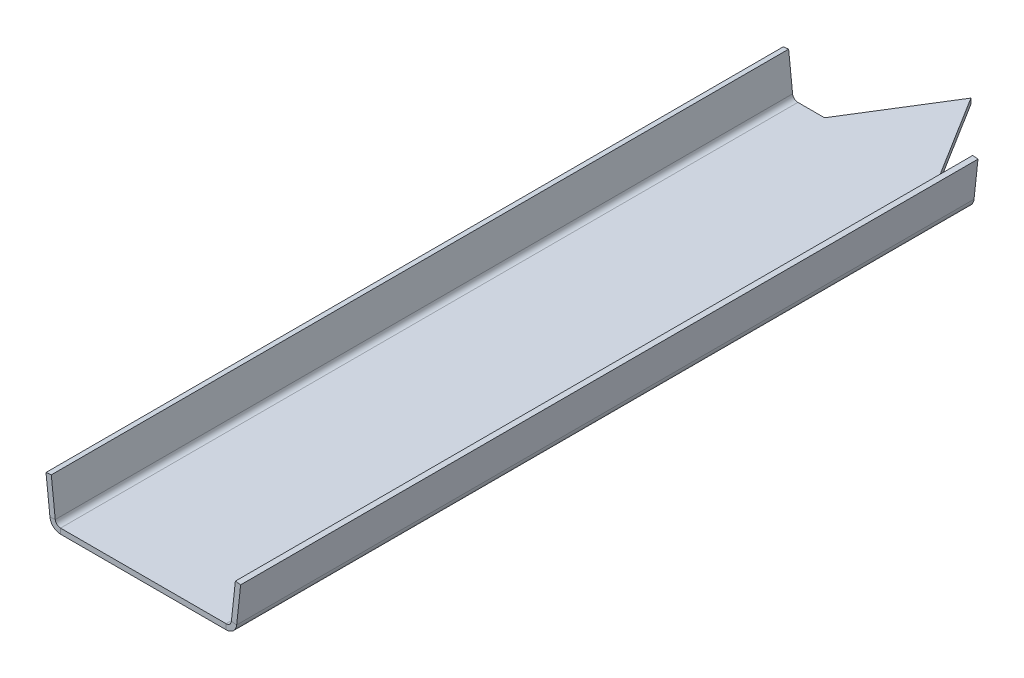
ISO-10303-21;
HEADER;
FILE_DESCRIPTION(('STEP AP214'),'2;1');
FILE_NAME('part.step','',(''),(''),'','','');
FILE_SCHEMA(('AUTOMOTIVE_DESIGN { 1 0 10303 214 1 1 1 1 }'));
ENDSEC;
DATA;
#1=APPLICATION_CONTEXT('core data for automotive mechanical design processes');
#2=APPLICATION_PROTOCOL_DEFINITION('international standard','automotive_design',2000,#1);
#3=PRODUCT_CONTEXT('',#1,'mechanical');
#4=PRODUCT('Part','Part','',(#3));
#5=PRODUCT_RELATED_PRODUCT_CATEGORY('part','',(#4));
#6=PRODUCT_DEFINITION_FORMATION('','',#4);
#7=PRODUCT_DEFINITION_CONTEXT('part definition',#1,'design');
#8=PRODUCT_DEFINITION('design','',#6,#7);
#9=PRODUCT_DEFINITION_SHAPE('','',#8);
#10=(LENGTH_UNIT() NAMED_UNIT(*) SI_UNIT(.MILLI.,.METRE.));
#11=(NAMED_UNIT(*) PLANE_ANGLE_UNIT() SI_UNIT($,.RADIAN.));
#12=(NAMED_UNIT(*) SI_UNIT($,.STERADIAN.) SOLID_ANGLE_UNIT());
#13=UNCERTAINTY_MEASURE_WITH_UNIT(LENGTH_MEASURE(1.E-05),#10,'distance_accuracy_value','');
#14=(GEOMETRIC_REPRESENTATION_CONTEXT(3) GLOBAL_UNCERTAINTY_ASSIGNED_CONTEXT((#13)) GLOBAL_UNIT_ASSIGNED_CONTEXT((#10,
#11,#12)) REPRESENTATION_CONTEXT('',''));
#15=CARTESIAN_POINT('',(0.,0.,0.));
#16=DIRECTION('',(0.,0.,1.));
#17=DIRECTION('',(1.,0.,0.));
#18=AXIS2_PLACEMENT_3D('',#15,#16,#17);
#19=CARTESIAN_POINT('',(13.9144750723848,-54.4541973925181,0.));
#20=DIRECTION('',(0.,0.,-1.));
#21=DIRECTION('',(-1.,0.,0.));
#22=AXIS2_PLACEMENT_3D('',#19,#20,#21);
#23=PLANE('',#22);
#24=DIRECTION('',(0.,1.,0.));
#25=VECTOR('',#24,1.);
#26=CARTESIAN_POINT('',(62.,-69.5970545353753,0.));
#27=LINE('',#26,#25);
#28=CARTESIAN_POINT('',(62.,-69.5970545353753,0.));
#29=VERTEX_POINT('',#28);
#30=CARTESIAN_POINT('',(62.,-61.5970545353753,0.));
#31=VERTEX_POINT('',#30);
#32=EDGE_CURVE('E187',#29,#31,#27,.T.);
#33=ORIENTED_EDGE('',*,*,#32,.F.);
#34=DIRECTION('',(1.,0.,0.));
#35=VECTOR('',#34,1.);
#36=CARTESIAN_POINT('',(7.49999999999995,-69.5970545353753,0.));
#37=LINE('',#36,#35);
#38=CARTESIAN_POINT('',(21.868424162142,-69.5970545353753,0.));
#39=VERTEX_POINT('',#38);
#40=EDGE_CURVE('E213',#39,#29,#37,.T.);
#41=ORIENTED_EDGE('',*,*,#40,.F.);
#42=DIRECTION('',(0.,1.,0.));
#43=VECTOR('',#42,1.);
#44=CARTESIAN_POINT('',(21.868424162142,-69.5970545353753,0.));
#45=LINE('',#44,#43);
#46=CARTESIAN_POINT('',(21.868424162142,-61.5970545353753,0.));
#47=VERTEX_POINT('',#46);
#48=EDGE_CURVE('E154',#39,#47,#45,.T.);
#49=ORIENTED_EDGE('',*,*,#48,.T.);
#50=DIRECTION('',(1.,0.,0.));
#51=VECTOR('',#50,1.);
#52=CARTESIAN_POINT('',(7.49999999999995,-61.5970545353753,0.));
#53=LINE('',#52,#51);
#54=EDGE_CURVE('E196',#47,#31,#53,.T.);
#55=ORIENTED_EDGE('',*,*,#54,.T.);
#56=EDGE_LOOP('',(#33,#41,#49,#55));
#57=FACE_BOUND('',#56,.T.);
#58=ADVANCED_FACE('F38',(#57),#23,.T.);
#59=CARTESIAN_POINT('',(5.9605259826276,-55.311340249661,1110.));
#60=DIRECTION('',(0.,0.,1.));
#61=DIRECTION('',(1.,0.,0.));
#62=AXIS2_PLACEMENT_3D('',#59,#60,#61);
#63=PLANE('',#62);
#64=DIRECTION('',(0.994243636219647,0.107142857142857,0.));
#65=VECTOR('',#64,1.);
#66=CARTESIAN_POINT('',(5.9605259826276,-55.311340249661,1110.));
#67=LINE('',#66,#65);
#68=CARTESIAN_POINT('',(5.9605259826276,-55.311340249661,1110.));
#69=VERTEX_POINT('',#68);
#70=CARTESIAN_POINT('',(13.9144750723848,-54.4541973925181,1110.));
#71=VERTEX_POINT('',#70);
#72=EDGE_CURVE('E11',#69,#71,#67,.T.);
#73=ORIENTED_EDGE('',*,*,#72,.F.);
#74=CARTESIAN_POINT('',(21.868424162142,-53.5970545353753,1110.));
#75=DIRECTION('',(0.,0.,-1.));
#76=DIRECTION('',(-1.,0.,0.));
#77=AXIS2_PLACEMENT_3D('',#74,#75,#76);
#78=CIRCLE('',#77,16.);
#79=CARTESIAN_POINT('',(21.868424162142,-69.5970545353753,1110.));
#80=VERTEX_POINT('',#79);
#81=EDGE_CURVE('E156',#69,#80,#78,.F.);
#82=ORIENTED_EDGE('',*,*,#81,.T.);
#83=DIRECTION('',(0.,-1.,0.));
#84=VECTOR('',#83,1.);
#85=CARTESIAN_POINT('',(21.868424162142,-61.5970545353753,1110.));
#86=LINE('',#85,#84);
#87=CARTESIAN_POINT('',(21.868424162142,-61.5970545353753,1110.));
#88=VERTEX_POINT('',#87);
#89=EDGE_CURVE('E46',#88,#80,#86,.T.);
#90=ORIENTED_EDGE('',*,*,#89,.F.);
#91=CARTESIAN_POINT('',(21.868424162142,-53.5970545353753,1110.));
#92=DIRECTION('',(0.,0.,1.));
#93=DIRECTION('',(1.,0.,0.));
#94=AXIS2_PLACEMENT_3D('',#91,#92,#93);
#95=CIRCLE('',#94,8.);
#96=EDGE_CURVE('E258',#71,#88,#95,.T.);
#97=ORIENTED_EDGE('',*,*,#96,.F.);
#98=EDGE_LOOP('',(#73,#82,#90,#97));
#99=FACE_BOUND('',#98,.T.);
#100=ADVANCED_FACE('F40',(#99),#63,.T.);
#101=CARTESIAN_POINT('',(21.868424162142,-61.5970545353753,1110.));
#102=DIRECTION('',(0.,0.,1.));
#103=DIRECTION('',(1.,0.,0.));
#104=AXIS2_PLACEMENT_3D('',#101,#102,#103);
#105=PLANE('',#104);
#106=DIRECTION('',(0.107142857142856,-0.994243636219647,0.));
#107=VECTOR('',#106,1.);
#108=CARTESIAN_POINT('',(0.,0.,1110.));
#109=LINE('',#108,#107);
#110=CARTESIAN_POINT('',(0.,0.,1110.));
#111=VERTEX_POINT('',#110);
#112=EDGE_CURVE('E161',#111,#69,#109,.T.);
#113=ORIENTED_EDGE('',*,*,#112,.T.);
#114=ORIENTED_EDGE('',*,*,#72,.T.);
#115=DIRECTION('',(0.107142857142856,-0.994243636219647,0.));
#116=VECTOR('',#115,1.);
#117=CARTESIAN_POINT('',(7.95394908975718,0.857142857142852,1110.));
#118=LINE('',#117,#116);
#119=CARTESIAN_POINT('',(7.95394908975718,0.857142857142852,1110.));
#120=VERTEX_POINT('',#119);
#121=EDGE_CURVE('E273',#120,#71,#118,.T.);
#122=ORIENTED_EDGE('',*,*,#121,.F.);
#123=DIRECTION('',(0.994243636219647,0.107142857142856,0.));
#124=VECTOR('',#123,1.);
#125=CARTESIAN_POINT('',(0.,0.,1110.));
#126=LINE('',#125,#124);
#127=EDGE_CURVE('E275',#111,#120,#126,.T.);
#128=ORIENTED_EDGE('',*,*,#127,.F.);
#129=EDGE_LOOP('',(#113,#114,#122,#128));
#130=FACE_BOUND('',#129,.T.);
#131=ADVANCED_FACE('F286',(#130),#105,.T.);
#132=CARTESIAN_POINT('',(21.868424162142,-69.5970545353753,0.));
#133=DIRECTION('',(0.,0.,-1.));
#134=DIRECTION('',(-1.,0.,0.));
#135=AXIS2_PLACEMENT_3D('',#132,#133,#134);
#136=PLANE('',#135);
#137=ORIENTED_EDGE('',*,*,#48,.F.);
#138=CARTESIAN_POINT('',(21.868424162142,-53.5970545353753,0.));
#139=DIRECTION('',(0.,0.,-1.));
#140=DIRECTION('',(-1.,0.,0.));
#141=AXIS2_PLACEMENT_3D('',#138,#139,#140);
#142=CIRCLE('',#141,16.);
#143=CARTESIAN_POINT('',(5.9605259826276,-55.311340249661,0.));
#144=VERTEX_POINT('',#143);
#145=EDGE_CURVE('E168',#144,#39,#142,.F.);
#146=ORIENTED_EDGE('',*,*,#145,.F.);
#147=DIRECTION('',(-0.994243636219647,-0.107142857142857,0.));
#148=VECTOR('',#147,1.);
#149=CARTESIAN_POINT('',(13.9144750723848,-54.4541973925181,0.));
#150=LINE('',#149,#148);
#151=CARTESIAN_POINT('',(13.9144750723848,-54.4541973925181,0.));
#152=VERTEX_POINT('',#151);
#153=EDGE_CURVE('E248',#152,#144,#150,.T.);
#154=ORIENTED_EDGE('',*,*,#153,.F.);
#155=CARTESIAN_POINT('',(21.868424162142,-53.5970545353753,0.));
#156=DIRECTION('',(0.,0.,1.));
#157=DIRECTION('',(1.,0.,0.));
#158=AXIS2_PLACEMENT_3D('',#155,#156,#157);
#159=CIRCLE('',#158,8.);
#160=EDGE_CURVE('E199',#152,#47,#159,.T.);
#161=ORIENTED_EDGE('',*,*,#160,.T.);
#162=EDGE_LOOP('',(#137,#146,#154,#161));
#163=FACE_BOUND('',#162,.T.);
#164=ADVANCED_FACE('F265',(#163),#136,.T.);
#165=DIRECTION('',(0.,1.,0.));
#166=VECTOR('',#165,1.);
#167=CARTESIAN_POINT('',(231.,-69.5970545353753,0.));
#168=LINE('',#167,#166);
#169=CARTESIAN_POINT('',(231.,-69.5970545353752,0.));
#170=VERTEX_POINT('',#169);
#171=CARTESIAN_POINT('',(231.,-61.5970545353753,0.));
#172=VERTEX_POINT('',#171);
#173=EDGE_CURVE('E320',#170,#172,#168,.T.);
#174=ORIENTED_EDGE('',*,*,#173,.T.);
#175=CARTESIAN_POINT('',(271.131575837858,-61.5970545353752,0.));
#176=VERTEX_POINT('',#175);
#177=EDGE_CURVE('E195',#172,#176,#53,.T.);
#178=ORIENTED_EDGE('',*,*,#177,.T.);
#179=DIRECTION('',(0.,-1.,0.));
#180=VECTOR('',#179,1.);
#181=CARTESIAN_POINT('',(271.131575837858,-61.5970545353752,0.));
#182=LINE('',#181,#180);
#183=CARTESIAN_POINT('',(271.131575837858,-69.5970545353752,0.));
#184=VERTEX_POINT('',#183);
#185=EDGE_CURVE('E241',#176,#184,#182,.T.);
#186=ORIENTED_EDGE('',*,*,#185,.T.);
#187=EDGE_CURVE('E212',#170,#184,#37,.T.);
#188=ORIENTED_EDGE('',*,*,#187,.F.);
#189=EDGE_LOOP('',(#174,#178,#186,#188));
#190=FACE_BOUND('',#189,.T.);
#191=ADVANCED_FACE('F303',(#190),#23,.T.);
#192=CARTESIAN_POINT('',(271.131575837858,-69.5970545353752,1110.));
#193=DIRECTION('',(0.,0.,1.));
#194=DIRECTION('',(1.,0.,0.));
#195=AXIS2_PLACEMENT_3D('',#192,#193,#194);
#196=PLANE('',#195);
#197=DIRECTION('',(0.,1.,0.));
#198=VECTOR('',#197,1.);
#199=CARTESIAN_POINT('',(271.131575837858,-69.5970545353752,1110.));
#200=LINE('',#199,#198);
#201=CARTESIAN_POINT('',(271.131575837858,-69.5970545353752,1110.));
#202=VERTEX_POINT('',#201);
#203=CARTESIAN_POINT('',(271.131575837858,-61.5970545353752,1110.));
#204=VERTEX_POINT('',#203);
#205=EDGE_CURVE('E246',#202,#204,#200,.T.);
#206=ORIENTED_EDGE('',*,*,#205,.F.);
#207=CARTESIAN_POINT('',(271.131575837858,-53.5970545353752,1110.));
#208=DIRECTION('',(0.,0.,-1.));
#209=DIRECTION('',(-1.,0.,0.));
#210=AXIS2_PLACEMENT_3D('',#207,#208,#209);
#211=CIRCLE('',#210,16.);
#212=CARTESIAN_POINT('',(287.039474017372,-55.3113402496609,1110.));
#213=VERTEX_POINT('',#212);
#214=EDGE_CURVE('E177',#202,#213,#211,.F.);
#215=ORIENTED_EDGE('',*,*,#214,.T.);
#216=DIRECTION('',(0.994243636219647,-0.107142857142857,0.));
#217=VECTOR('',#216,1.);
#218=CARTESIAN_POINT('',(279.085524927615,-54.4541973925181,1110.));
#219=LINE('',#218,#217);
#220=CARTESIAN_POINT('',(279.085524927615,-54.4541973925181,1110.));
#221=VERTEX_POINT('',#220);
#222=EDGE_CURVE('E62',#221,#213,#219,.T.);
#223=ORIENTED_EDGE('',*,*,#222,.F.);
#224=CARTESIAN_POINT('',(271.131575837858,-53.5970545353752,1110.));
#225=DIRECTION('',(0.,0.,1.));
#226=DIRECTION('',(1.,0.,0.));
#227=AXIS2_PLACEMENT_3D('',#224,#225,#226);
#228=CIRCLE('',#227,8.);
#229=EDGE_CURVE('E277',#204,#221,#228,.T.);
#230=ORIENTED_EDGE('',*,*,#229,.F.);
#231=EDGE_LOOP('',(#206,#215,#223,#230));
#232=FACE_BOUND('',#231,.T.);
#233=ADVANCED_FACE('F310',(#232),#196,.T.);
#234=CARTESIAN_POINT('',(279.085524927615,-54.4541973925181,1110.));
#235=DIRECTION('',(0.,0.,1.));
#236=DIRECTION('',(1.,0.,0.));
#237=AXIS2_PLACEMENT_3D('',#234,#235,#236);
#238=PLANE('',#237);
#239=DIRECTION('',(1.,0.,0.));
#240=VECTOR('',#239,1.);
#241=CARTESIAN_POINT('',(7.49999999999995,-69.5970545353753,1110.));
#242=LINE('',#241,#240);
#243=EDGE_CURVE('E146',#80,#202,#242,.T.);
#244=ORIENTED_EDGE('',*,*,#243,.T.);
#245=ORIENTED_EDGE('',*,*,#205,.T.);
#246=DIRECTION('',(1.,0.,0.));
#247=VECTOR('',#246,1.);
#248=CARTESIAN_POINT('',(7.49999999999995,-61.5970545353753,1110.));
#249=LINE('',#248,#247);
#250=EDGE_CURVE('E149',#88,#204,#249,.T.);
#251=ORIENTED_EDGE('',*,*,#250,.F.);
#252=ORIENTED_EDGE('',*,*,#89,.T.);
#253=EDGE_LOOP('',(#244,#245,#251,#252));
#254=FACE_BOUND('',#253,.T.);
#255=ADVANCED_FACE('F144',(#254),#238,.T.);
#256=CARTESIAN_POINT('',(287.039474017372,-55.3113402496609,0.));
#257=DIRECTION('',(0.,0.,-1.));
#258=DIRECTION('',(-1.,0.,0.));
#259=AXIS2_PLACEMENT_3D('',#256,#257,#258);
#260=PLANE('',#259);
#261=DIRECTION('',(-0.994243636219647,0.107142857142857,0.));
#262=VECTOR('',#261,1.);
#263=CARTESIAN_POINT('',(287.039474017372,-55.3113402496609,0.));
#264=LINE('',#263,#262);
#265=CARTESIAN_POINT('',(287.039474017372,-55.3113402496609,0.));
#266=VERTEX_POINT('',#265);
#267=CARTESIAN_POINT('',(279.085524927615,-54.4541973925181,0.));
#268=VERTEX_POINT('',#267);
#269=EDGE_CURVE('E107',#266,#268,#264,.T.);
#270=ORIENTED_EDGE('',*,*,#269,.F.);
#271=CARTESIAN_POINT('',(271.131575837858,-53.5970545353752,0.));
#272=DIRECTION('',(0.,0.,-1.));
#273=DIRECTION('',(-1.,0.,0.));
#274=AXIS2_PLACEMENT_3D('',#271,#272,#273);
#275=CIRCLE('',#274,16.);
#276=EDGE_CURVE('E215',#184,#266,#275,.F.);
#277=ORIENTED_EDGE('',*,*,#276,.F.);
#278=ORIENTED_EDGE('',*,*,#185,.F.);
#279=CARTESIAN_POINT('',(271.131575837858,-53.5970545353752,0.));
#280=DIRECTION('',(0.,0.,1.));
#281=DIRECTION('',(1.,0.,0.));
#282=AXIS2_PLACEMENT_3D('',#279,#280,#281);
#283=CIRCLE('',#282,8.);
#284=EDGE_CURVE('E193',#176,#268,#283,.T.);
#285=ORIENTED_EDGE('',*,*,#284,.T.);
#286=EDGE_LOOP('',(#270,#277,#278,#285));
#287=FACE_BOUND('',#286,.T.);
#288=ADVANCED_FACE('F339',(#287),#260,.T.);
#289=CARTESIAN_POINT('',(271.131575837858,-61.5970545353752,0.));
#290=DIRECTION('',(0.,0.,-1.));
#291=DIRECTION('',(-1.,0.,0.));
#292=AXIS2_PLACEMENT_3D('',#289,#290,#291);
#293=PLANE('',#292);
#294=DIRECTION('',(0.107142857142856,0.994243636219647,0.));
#295=VECTOR('',#294,1.);
#296=CARTESIAN_POINT('',(285.5,-69.5970545353752,0.));
#297=LINE('',#296,#295);
#298=CARTESIAN_POINT('',(293.,0.,0.));
#299=VERTEX_POINT('',#298);
#300=EDGE_CURVE('E183',#266,#299,#297,.T.);
#301=ORIENTED_EDGE('',*,*,#300,.F.);
#302=ORIENTED_EDGE('',*,*,#269,.T.);
#303=DIRECTION('',(0.107142857142856,0.994243636219647,0.));
#304=VECTOR('',#303,1.);
#305=CARTESIAN_POINT('',(277.546050910243,-68.7399116782324,0.));
#306=LINE('',#305,#304);
#307=CARTESIAN_POINT('',(285.046050910243,0.857142857142904,0.));
#308=VERTEX_POINT('',#307);
#309=EDGE_CURVE('E190',#268,#308,#306,.T.);
#310=ORIENTED_EDGE('',*,*,#309,.T.);
#311=DIRECTION('',(0.994243636219647,-0.107142857142859,0.));
#312=VECTOR('',#311,1.);
#313=CARTESIAN_POINT('',(285.046050910243,0.857142857142904,0.));
#314=LINE('',#313,#312);
#315=EDGE_CURVE('E186',#308,#299,#314,.T.);
#316=ORIENTED_EDGE('',*,*,#315,.T.);
#317=EDGE_LOOP('',(#301,#302,#310,#316));
#318=FACE_BOUND('',#317,.T.);
#319=ADVANCED_FACE('F493',(#318),#293,.T.);
#320=CARTESIAN_POINT('',(285.5,-69.5970545353752,1110.));
#321=DIRECTION('',(-0.994243636219647,0.107142857142856,0.));
#322=DIRECTION('',(-0.107142857142856,-0.994243636219647,0.));
#323=AXIS2_PLACEMENT_3D('',#320,#321,#322);
#324=PLANE('',#323);
#325=ORIENTED_EDGE('',*,*,#300,.T.);
#326=DIRECTION('',(0.,0.,-1.));
#327=VECTOR('',#326,1.);
#328=CARTESIAN_POINT('',(293.,0.,1110.));
#329=LINE('',#328,#327);
#330=CARTESIAN_POINT('',(293.,0.,1110.));
#331=VERTEX_POINT('',#330);
#332=EDGE_CURVE('E239',#331,#299,#329,.T.);
#333=ORIENTED_EDGE('',*,*,#332,.F.);
#334=DIRECTION('',(0.107142857142856,0.994243636219647,0.));
#335=VECTOR('',#334,1.);
#336=CARTESIAN_POINT('',(285.5,-69.5970545353752,1110.));
#337=LINE('',#336,#335);
#338=EDGE_CURVE('E113',#213,#331,#337,.T.);
#339=ORIENTED_EDGE('',*,*,#338,.F.);
#340=DIRECTION('',(0.,0.,-1.));
#341=VECTOR('',#340,1.);
#342=CARTESIAN_POINT('',(287.039474017372,-55.3113402496609,1110.));
#343=LINE('',#342,#341);
#344=EDGE_CURVE('E179',#213,#266,#343,.T.);
#345=ORIENTED_EDGE('',*,*,#344,.T.);
#346=EDGE_LOOP('',(#325,#333,#339,#345));
#347=FACE_BOUND('',#346,.T.);
#348=ADVANCED_FACE('F522',(#347),#324,.F.);
#349=CARTESIAN_POINT('',(285.046050910243,0.857142857142904,1110.));
#350=DIRECTION('',(0.107142857142859,0.994243636219647,0.));
#351=DIRECTION('',(-0.994243636219647,0.107142857142859,0.));
#352=AXIS2_PLACEMENT_3D('',#349,#350,#351);
#353=PLANE('',#352);
#354=ORIENTED_EDGE('',*,*,#315,.F.);
#355=DIRECTION('',(0.,0.,-1.));
#356=VECTOR('',#355,1.);
#357=CARTESIAN_POINT('',(285.046050910243,0.857142857142904,1110.));
#358=LINE('',#357,#356);
#359=CARTESIAN_POINT('',(285.046050910243,0.857142857142904,1110.));
#360=VERTEX_POINT('',#359);
#361=EDGE_CURVE('E237',#360,#308,#358,.T.);
#362=ORIENTED_EDGE('',*,*,#361,.F.);
#363=DIRECTION('',(0.994243636219647,-0.107142857142859,0.));
#364=VECTOR('',#363,1.);
#365=CARTESIAN_POINT('',(285.046050910243,0.857142857142904,1110.));
#366=LINE('',#365,#364);
#367=EDGE_CURVE('E345',#360,#331,#366,.T.);
#368=ORIENTED_EDGE('',*,*,#367,.T.);
#369=ORIENTED_EDGE('',*,*,#332,.T.);
#370=EDGE_LOOP('',(#354,#362,#368,#369));
#371=FACE_BOUND('',#370,.T.);
#372=ADVANCED_FACE('F532',(#371),#353,.T.);
#373=CARTESIAN_POINT('',(277.546050910243,-68.7399116782324,1110.));
#374=DIRECTION('',(-0.994243636219647,0.107142857142856,0.));
#375=DIRECTION('',(-0.107142857142856,-0.994243636219647,0.));
#376=AXIS2_PLACEMENT_3D('',#373,#374,#375);
#377=PLANE('',#376);
#378=ORIENTED_EDGE('',*,*,#309,.F.);
#379=DIRECTION('',(0.,0.,-1.));
#380=VECTOR('',#379,1.);
#381=CARTESIAN_POINT('',(279.085524927615,-54.4541973925181,1110.));
#382=LINE('',#381,#380);
#383=EDGE_CURVE('E234',#221,#268,#382,.T.);
#384=ORIENTED_EDGE('',*,*,#383,.F.);
#385=DIRECTION('',(0.107142857142856,0.994243636219647,0.));
#386=VECTOR('',#385,1.);
#387=CARTESIAN_POINT('',(277.546050910243,-68.7399116782324,1110.));
#388=LINE('',#387,#386);
#389=EDGE_CURVE('E343',#221,#360,#388,.T.);
#390=ORIENTED_EDGE('',*,*,#389,.T.);
#391=ORIENTED_EDGE('',*,*,#361,.T.);
#392=EDGE_LOOP('',(#378,#384,#390,#391));
#393=FACE_BOUND('',#392,.T.);
#394=ADVANCED_FACE('F485',(#393),#377,.T.);
#395=CARTESIAN_POINT('',(271.131575837858,-53.5970545353752,1110.));
#396=DIRECTION('',(0.,0.,-1.));
#397=DIRECTION('',(-1.,0.,0.));
#398=AXIS2_PLACEMENT_3D('',#395,#396,#397);
#399=CYLINDRICAL_SURFACE('',#398,8.);
#400=ORIENTED_EDGE('',*,*,#284,.F.);
#401=DIRECTION('',(0.,0.,-1.));
#402=VECTOR('',#401,1.);
#403=CARTESIAN_POINT('',(271.131575837858,-61.5970545353752,1110.));
#404=LINE('',#403,#402);
#405=EDGE_CURVE('E231',#204,#176,#404,.T.);
#406=ORIENTED_EDGE('',*,*,#405,.F.);
#407=ORIENTED_EDGE('',*,*,#229,.T.);
#408=ORIENTED_EDGE('',*,*,#383,.T.);
#409=EDGE_LOOP('',(#400,#406,#407,#408));
#410=FACE_BOUND('',#409,.T.);
#411=ADVANCED_FACE('F336',(#410),#399,.F.);
#412=CARTESIAN_POINT('',(7.49999999999995,-61.5970545353753,1110.));
#413=DIRECTION('',(0.,1.,0.));
#414=DIRECTION('',(-1.,0.,0.));
#415=AXIS2_PLACEMENT_3D('',#412,#413,#414);
#416=PLANE('',#415);
#417=ORIENTED_EDGE('',*,*,#54,.F.);
#418=DIRECTION('',(0.,0.,-1.));
#419=VECTOR('',#418,1.);
#420=CARTESIAN_POINT('',(21.868424162142,-61.5970545353753,1110.));
#421=LINE('',#420,#419);
#422=EDGE_CURVE('E228',#88,#47,#421,.T.);
#423=ORIENTED_EDGE('',*,*,#422,.F.);
#424=ORIENTED_EDGE('',*,*,#250,.T.);
#425=ORIENTED_EDGE('',*,*,#405,.T.);
#426=ORIENTED_EDGE('',*,*,#177,.F.);
#427=DIRECTION('',(-0.528124999999999,0.,-0.849166641110566));
#428=VECTOR('',#427,1.);
#429=CARTESIAN_POINT('',(146.5,-61.5970545353753,-135.866662577691));
#430=LINE('',#429,#428);
#431=CARTESIAN_POINT('',(146.5,-61.5970545353753,-135.866662577691));
#432=VERTEX_POINT('',#431);
#433=EDGE_CURVE('E330',#172,#432,#430,.T.);
#434=ORIENTED_EDGE('',*,*,#433,.T.);
#435=DIRECTION('',(-0.528124999999999,0.,0.849166641110566));
#436=VECTOR('',#435,1.);
#437=CARTESIAN_POINT('',(62.,-61.5970545353753,0.));
#438=LINE('',#437,#436);
#439=EDGE_CURVE('E264',#432,#31,#438,.T.);
#440=ORIENTED_EDGE('',*,*,#439,.T.);
#441=EDGE_LOOP('',(#417,#423,#424,#425,#426,#434,#440));
#442=FACE_BOUND('',#441,.T.);
#443=ADVANCED_FACE('F261',(#442),#416,.T.);
#444=CARTESIAN_POINT('',(21.868424162142,-53.5970545353753,1110.));
#445=DIRECTION('',(0.,0.,-1.));
#446=DIRECTION('',(-1.,0.,0.));
#447=AXIS2_PLACEMENT_3D('',#444,#445,#446);
#448=CYLINDRICAL_SURFACE('',#447,8.);
#449=ORIENTED_EDGE('',*,*,#160,.F.);
#450=DIRECTION('',(0.,0.,-1.));
#451=VECTOR('',#450,1.);
#452=CARTESIAN_POINT('',(13.9144750723848,-54.4541973925181,1110.));
#453=LINE('',#452,#451);
#454=EDGE_CURVE('E225',#71,#152,#453,.T.);
#455=ORIENTED_EDGE('',*,*,#454,.F.);
#456=ORIENTED_EDGE('',*,*,#96,.T.);
#457=ORIENTED_EDGE('',*,*,#422,.T.);
#458=EDGE_LOOP('',(#449,#455,#456,#457));
#459=FACE_BOUND('',#458,.T.);
#460=ADVANCED_FACE('F256',(#459),#448,.F.);
#461=CARTESIAN_POINT('',(7.95394908975718,0.857142857142852,1110.));
#462=DIRECTION('',(0.994243636219647,0.107142857142856,0.));
#463=DIRECTION('',(-0.107142857142856,0.994243636219647,0.));
#464=AXIS2_PLACEMENT_3D('',#461,#462,#463);
#465=PLANE('',#464);
#466=DIRECTION('',(0.107142857142856,-0.994243636219647,0.));
#467=VECTOR('',#466,1.);
#468=CARTESIAN_POINT('',(7.95394908975718,0.857142857142852,0.));
#469=LINE('',#468,#467);
#470=CARTESIAN_POINT('',(7.95394908975718,0.857142857142852,0.));
#471=VERTEX_POINT('',#470);
#472=EDGE_CURVE('E202',#471,#152,#469,.T.);
#473=ORIENTED_EDGE('',*,*,#472,.F.);
#474=DIRECTION('',(0.,0.,-1.));
#475=VECTOR('',#474,1.);
#476=CARTESIAN_POINT('',(7.95394908975718,0.857142857142852,1110.));
#477=LINE('',#476,#475);
#478=EDGE_CURVE('E223',#120,#471,#477,.T.);
#479=ORIENTED_EDGE('',*,*,#478,.F.);
#480=ORIENTED_EDGE('',*,*,#121,.T.);
#481=ORIENTED_EDGE('',*,*,#454,.T.);
#482=EDGE_LOOP('',(#473,#479,#480,#481));
#483=FACE_BOUND('',#482,.T.);
#484=ADVANCED_FACE('F271',(#483),#465,.T.);
#485=CARTESIAN_POINT('',(0.,0.,1110.));
#486=DIRECTION('',(-0.107142857142856,0.994243636219647,0.));
#487=DIRECTION('',(-0.994243636219647,-0.107142857142856,0.));
#488=AXIS2_PLACEMENT_3D('',#485,#486,#487);
#489=PLANE('',#488);
#490=DIRECTION('',(0.994243636219647,0.107142857142856,0.));
#491=VECTOR('',#490,1.);
#492=CARTESIAN_POINT('',(0.,0.,0.));
#493=LINE('',#492,#491);
#494=CARTESIAN_POINT('',(0.,0.,0.));
#495=VERTEX_POINT('',#494);
#496=EDGE_CURVE('E205',#495,#471,#493,.T.);
#497=ORIENTED_EDGE('',*,*,#496,.F.);
#498=DIRECTION('',(0.,0.,-1.));
#499=VECTOR('',#498,1.);
#500=CARTESIAN_POINT('',(0.,0.,1110.));
#501=LINE('',#500,#499);
#502=EDGE_CURVE('E221',#111,#495,#501,.T.);
#503=ORIENTED_EDGE('',*,*,#502,.F.);
#504=ORIENTED_EDGE('',*,*,#127,.T.);
#505=ORIENTED_EDGE('',*,*,#478,.T.);
#506=EDGE_LOOP('',(#497,#503,#504,#505));
#507=FACE_BOUND('',#506,.T.);
#508=ADVANCED_FACE('F292',(#507),#489,.T.);
#509=CARTESIAN_POINT('',(0.,0.,1110.));
#510=DIRECTION('',(0.994243636219647,0.107142857142856,0.));
#511=DIRECTION('',(-0.107142857142856,0.994243636219647,0.));
#512=AXIS2_PLACEMENT_3D('',#509,#510,#511);
#513=PLANE('',#512);
#514=DIRECTION('',(0.107142857142856,-0.994243636219647,0.));
#515=VECTOR('',#514,1.);
#516=CARTESIAN_POINT('',(0.,0.,0.));
#517=LINE('',#516,#515);
#518=EDGE_CURVE('E208',#495,#144,#517,.T.);
#519=ORIENTED_EDGE('',*,*,#518,.T.);
#520=DIRECTION('',(0.,0.,-1.));
#521=VECTOR('',#520,1.);
#522=CARTESIAN_POINT('',(5.9605259826276,-55.311340249661,1110.));
#523=LINE('',#522,#521);
#524=EDGE_CURVE('E171',#69,#144,#523,.T.);
#525=ORIENTED_EDGE('',*,*,#524,.F.);
#526=ORIENTED_EDGE('',*,*,#112,.F.);
#527=ORIENTED_EDGE('',*,*,#502,.T.);
#528=EDGE_LOOP('',(#519,#525,#526,#527));
#529=FACE_BOUND('',#528,.T.);
#530=ADVANCED_FACE('F288',(#529),#513,.F.);
#531=CARTESIAN_POINT('',(21.868424162142,-53.5970545353753,1110.));
#532=DIRECTION('',(0.,0.,-1.));
#533=DIRECTION('',(-1.,0.,0.));
#534=AXIS2_PLACEMENT_3D('',#531,#532,#533);
#535=CYLINDRICAL_SURFACE('',#534,16.);
#536=ORIENTED_EDGE('',*,*,#145,.T.);
#537=DIRECTION('',(0.,0.,-1.));
#538=VECTOR('',#537,1.);
#539=CARTESIAN_POINT('',(21.868424162142,-69.5970545353753,1110.));
#540=LINE('',#539,#538);
#541=EDGE_CURVE('E165',#80,#39,#540,.T.);
#542=ORIENTED_EDGE('',*,*,#541,.F.);
#543=ORIENTED_EDGE('',*,*,#81,.F.);
#544=ORIENTED_EDGE('',*,*,#524,.T.);
#545=EDGE_LOOP('',(#536,#542,#543,#544));
#546=FACE_BOUND('',#545,.T.);
#547=ADVANCED_FACE('F166',(#546),#535,.T.);
#548=CARTESIAN_POINT('',(7.49999999999995,-69.5970545353753,1110.));
#549=DIRECTION('',(0.,1.,0.));
#550=DIRECTION('',(-1.,0.,0.));
#551=AXIS2_PLACEMENT_3D('',#548,#549,#550);
#552=PLANE('',#551);
#553=ORIENTED_EDGE('',*,*,#40,.T.);
#554=DIRECTION('',(-0.528124999999999,0.,0.849166641110566));
#555=VECTOR('',#554,1.);
#556=CARTESIAN_POINT('',(62.,-69.5970545353753,0.));
#557=LINE('',#556,#555);
#558=CARTESIAN_POINT('',(146.5,-69.5970545353753,-135.866662577691));
#559=VERTEX_POINT('',#558);
#560=EDGE_CURVE('E328',#559,#29,#557,.T.);
#561=ORIENTED_EDGE('',*,*,#560,.F.);
#562=DIRECTION('',(-0.528124999999999,0.,-0.849166641110566));
#563=VECTOR('',#562,1.);
#564=CARTESIAN_POINT('',(146.5,-69.5970545353753,-135.866662577691));
#565=LINE('',#564,#563);
#566=EDGE_CURVE('E53',#170,#559,#565,.T.);
#567=ORIENTED_EDGE('',*,*,#566,.F.);
#568=ORIENTED_EDGE('',*,*,#187,.T.);
#569=DIRECTION('',(0.,0.,-1.));
#570=VECTOR('',#569,1.);
#571=CARTESIAN_POINT('',(271.131575837858,-69.5970545353752,1110.));
#572=LINE('',#571,#570);
#573=EDGE_CURVE('E172',#202,#184,#572,.T.);
#574=ORIENTED_EDGE('',*,*,#573,.F.);
#575=ORIENTED_EDGE('',*,*,#243,.F.);
#576=ORIENTED_EDGE('',*,*,#541,.T.);
#577=EDGE_LOOP('',(#553,#561,#567,#568,#574,#575,#576));
#578=FACE_BOUND('',#577,.T.);
#579=ADVANCED_FACE('F174',(#578),#552,.F.);
#580=CARTESIAN_POINT('',(271.131575837858,-53.5970545353752,1110.));
#581=DIRECTION('',(0.,0.,-1.));
#582=DIRECTION('',(-1.,0.,0.));
#583=AXIS2_PLACEMENT_3D('',#580,#581,#582);
#584=CYLINDRICAL_SURFACE('',#583,16.);
#585=ORIENTED_EDGE('',*,*,#276,.T.);
#586=ORIENTED_EDGE('',*,*,#344,.F.);
#587=ORIENTED_EDGE('',*,*,#214,.F.);
#588=ORIENTED_EDGE('',*,*,#573,.T.);
#589=EDGE_LOOP('',(#585,#586,#587,#588));
#590=FACE_BOUND('',#589,.T.);
#591=ADVANCED_FACE('F341',(#590),#584,.T.);
#592=CARTESIAN_POINT('',(271.131575837858,-53.5970545353752,1110.));
#593=DIRECTION('',(0.,0.,1.));
#594=DIRECTION('',(1.,0.,0.));
#595=AXIS2_PLACEMENT_3D('',#592,#593,#594);
#596=PLANE('',#595);
#597=ORIENTED_EDGE('',*,*,#338,.T.);
#598=ORIENTED_EDGE('',*,*,#367,.F.);
#599=ORIENTED_EDGE('',*,*,#389,.F.);
#600=ORIENTED_EDGE('',*,*,#222,.T.);
#601=EDGE_LOOP('',(#597,#598,#599,#600));
#602=FACE_BOUND('',#601,.T.);
#603=ADVANCED_FACE('F373',(#602),#596,.T.);
#604=CARTESIAN_POINT('',(271.131575837858,-53.5970545353752,0.));
#605=DIRECTION('',(0.,0.,1.));
#606=DIRECTION('',(1.,0.,0.));
#607=AXIS2_PLACEMENT_3D('',#604,#605,#606);
#608=PLANE('',#607);
#609=ORIENTED_EDGE('',*,*,#472,.T.);
#610=ORIENTED_EDGE('',*,*,#153,.T.);
#611=ORIENTED_EDGE('',*,*,#518,.F.);
#612=ORIENTED_EDGE('',*,*,#496,.T.);
#613=EDGE_LOOP('',(#609,#610,#611,#612));
#614=FACE_BOUND('',#613,.T.);
#615=ADVANCED_FACE('F290',(#614),#608,.F.);
#616=CARTESIAN_POINT('',(62.,-69.5970545353753,0.));
#617=DIRECTION('',(-0.849166641110566,0.,-0.528124999999999));
#618=DIRECTION('',(-0.528125,0.,0.849166641110566));
#619=AXIS2_PLACEMENT_3D('',#616,#617,#618);
#620=PLANE('',#619);
#621=ORIENTED_EDGE('',*,*,#439,.F.);
#622=DIRECTION('',(0.,1.,0.));
#623=VECTOR('',#622,1.);
#624=CARTESIAN_POINT('',(146.5,-69.5970545353753,-135.866662577691));
#625=LINE('',#624,#623);
#626=EDGE_CURVE('E327',#559,#432,#625,.T.);
#627=ORIENTED_EDGE('',*,*,#626,.F.);
#628=ORIENTED_EDGE('',*,*,#560,.T.);
#629=ORIENTED_EDGE('',*,*,#32,.T.);
#630=EDGE_LOOP('',(#621,#627,#628,#629));
#631=FACE_BOUND('',#630,.T.);
#632=ADVANCED_FACE('F364',(#631),#620,.T.);
#633=CARTESIAN_POINT('',(146.5,-69.5970545353753,-135.866662577691));
#634=DIRECTION('',(0.849166641110566,0.,-0.528124999999999));
#635=DIRECTION('',(-0.528125,0.,-0.849166641110566));
#636=AXIS2_PLACEMENT_3D('',#633,#634,#635);
#637=PLANE('',#636);
#638=ORIENTED_EDGE('',*,*,#433,.F.);
#639=ORIENTED_EDGE('',*,*,#173,.F.);
#640=ORIENTED_EDGE('',*,*,#566,.T.);
#641=ORIENTED_EDGE('',*,*,#626,.T.);
#642=EDGE_LOOP('',(#638,#639,#640,#641));
#643=FACE_BOUND('',#642,.T.);
#644=ADVANCED_FACE('F360',(#643),#637,.T.);
#645=CLOSED_SHELL('',(#58,#100,#131,#164,#191,#233,#255,#288,#319,#348,#372,#394,#411,#443,#460,
#484,#508,#530,#547,#579,#591,#603,#615,#632,#644));
#646=MANIFOLD_SOLID_BREP('B2',#645);
#647=ADVANCED_BREP_SHAPE_REPRESENTATION('',(#18,#646),#14);
#648=SHAPE_DEFINITION_REPRESENTATION(#9,#647);
ENDSEC;
END-ISO-10303-21;
